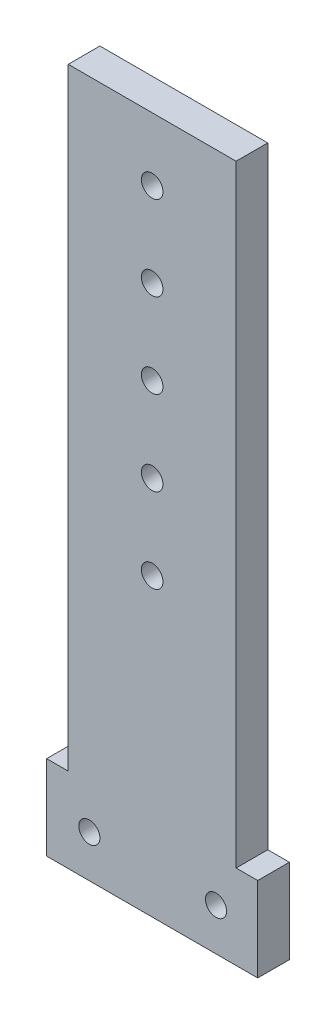
ISO-10303-21;
HEADER;
FILE_DESCRIPTION(('STEP AP214'),'2;1');
FILE_NAME('part.step','',(''),(''),'','','');
FILE_SCHEMA(('AUTOMOTIVE_DESIGN { 1 0 10303 214 1 1 1 1 }'));
ENDSEC;
DATA;
#1=APPLICATION_CONTEXT('core data for automotive mechanical design processes');
#2=APPLICATION_PROTOCOL_DEFINITION('international standard','automotive_design',2000,#1);
#3=PRODUCT_CONTEXT('',#1,'mechanical');
#4=PRODUCT('Part','Part','',(#3));
#5=PRODUCT_RELATED_PRODUCT_CATEGORY('part','',(#4));
#6=PRODUCT_DEFINITION_FORMATION('','',#4);
#7=PRODUCT_DEFINITION_CONTEXT('part definition',#1,'design');
#8=PRODUCT_DEFINITION('design','',#6,#7);
#9=PRODUCT_DEFINITION_SHAPE('','',#8);
#10=(LENGTH_UNIT() NAMED_UNIT(*) SI_UNIT(.MILLI.,.METRE.));
#11=(NAMED_UNIT(*) PLANE_ANGLE_UNIT() SI_UNIT($,.RADIAN.));
#12=(NAMED_UNIT(*) SI_UNIT($,.STERADIAN.) SOLID_ANGLE_UNIT());
#13=UNCERTAINTY_MEASURE_WITH_UNIT(LENGTH_MEASURE(1.E-05),#10,'distance_accuracy_value','');
#14=(GEOMETRIC_REPRESENTATION_CONTEXT(3) GLOBAL_UNCERTAINTY_ASSIGNED_CONTEXT((#13)) GLOBAL_UNIT_ASSIGNED_CONTEXT((#10,
#11,#12)) REPRESENTATION_CONTEXT('',''));
#15=CARTESIAN_POINT('',(0.,0.,0.));
#16=DIRECTION('',(0.,0.,1.));
#17=DIRECTION('',(1.,0.,0.));
#18=AXIS2_PLACEMENT_3D('',#15,#16,#17);
#19=CARTESIAN_POINT('',(0.,0.,9.525));
#20=DIRECTION('',(0.,0.,-1.));
#21=DIRECTION('',(-1.,0.,0.));
#22=AXIS2_PLACEMENT_3D('',#19,#20,#21);
#23=PLANE('',#22);
#24=DIRECTION('',(0.,1.,0.));
#25=VECTOR('',#24,1.);
#26=CARTESIAN_POINT('',(50.65,19.05,9.525));
#27=LINE('',#26,#25);
#28=CARTESIAN_POINT('',(50.65,19.05,9.525));
#29=VERTEX_POINT('',#28);
#30=CARTESIAN_POINT('',(50.65,203.2,9.525));
#31=VERTEX_POINT('',#30);
#32=EDGE_CURVE('E145',#29,#31,#27,.T.);
#33=ORIENTED_EDGE('',*,*,#32,.T.);
#34=DIRECTION('',(-1.,0.,0.));
#35=VECTOR('',#34,1.);
#36=CARTESIAN_POINT('',(0.149999999999997,203.2,9.525));
#37=LINE('',#36,#35);
#38=CARTESIAN_POINT('',(0.149999999999997,203.2,9.525));
#39=VERTEX_POINT('',#38);
#40=EDGE_CURVE('E93',#31,#39,#37,.T.);
#41=ORIENTED_EDGE('',*,*,#40,.T.);
#42=DIRECTION('',(0.,-1.,0.));
#43=VECTOR('',#42,1.);
#44=CARTESIAN_POINT('',(0.149999999999997,19.05,9.525));
#45=LINE('',#44,#43);
#46=CARTESIAN_POINT('',(0.149999999999997,19.05,9.525));
#47=VERTEX_POINT('',#46);
#48=EDGE_CURVE('E160',#39,#47,#45,.T.);
#49=ORIENTED_EDGE('',*,*,#48,.T.);
#50=DIRECTION('',(-1.,0.,0.));
#51=VECTOR('',#50,1.);
#52=CARTESIAN_POINT('',(0.149999999999997,19.05,9.525));
#53=LINE('',#52,#51);
#54=CARTESIAN_POINT('',(-6.35,19.05,9.525));
#55=VERTEX_POINT('',#54);
#56=EDGE_CURVE('E173',#47,#55,#53,.T.);
#57=ORIENTED_EDGE('',*,*,#56,.T.);
#58=DIRECTION('',(0.,-1.,0.));
#59=VECTOR('',#58,1.);
#60=CARTESIAN_POINT('',(-6.35,19.05,9.525));
#61=LINE('',#60,#59);
#62=CARTESIAN_POINT('',(-6.35,-6.35,9.525));
#63=VERTEX_POINT('',#62);
#64=EDGE_CURVE('E112',#55,#63,#61,.T.);
#65=ORIENTED_EDGE('',*,*,#64,.T.);
#66=DIRECTION('',(1.,0.,0.));
#67=VECTOR('',#66,1.);
#68=CARTESIAN_POINT('',(-6.35,-6.35,9.525));
#69=LINE('',#68,#67);
#70=CARTESIAN_POINT('',(57.15,-6.35,9.525));
#71=VERTEX_POINT('',#70);
#72=EDGE_CURVE('E106',#63,#71,#69,.T.);
#73=ORIENTED_EDGE('',*,*,#72,.T.);
#74=DIRECTION('',(0.,1.,0.));
#75=VECTOR('',#74,1.);
#76=CARTESIAN_POINT('',(57.15,-6.35,9.525));
#77=LINE('',#76,#75);
#78=CARTESIAN_POINT('',(57.15,19.05,9.525));
#79=VERTEX_POINT('',#78);
#80=EDGE_CURVE('E110',#71,#79,#77,.T.);
#81=ORIENTED_EDGE('',*,*,#80,.T.);
#82=DIRECTION('',(-1.,0.,0.));
#83=VECTOR('',#82,1.);
#84=CARTESIAN_POINT('',(57.15,19.05,9.525));
#85=LINE('',#84,#83);
#86=EDGE_CURVE('E50',#79,#29,#85,.T.);
#87=ORIENTED_EDGE('',*,*,#86,.T.);
#88=EDGE_LOOP('',(#33,#41,#49,#57,#65,#73,#81,#87));
#89=FACE_BOUND('',#88,.T.);
#90=CARTESIAN_POINT('',(6.5,6.35,9.525));
#91=DIRECTION('',(0.,0.,1.));
#92=DIRECTION('',(1.,0.,0.));
#93=AXIS2_PLACEMENT_3D('',#90,#91,#92);
#94=CIRCLE('',#93,3.175);
#95=CARTESIAN_POINT('',(9.675,6.35,9.525));
#96=VERTEX_POINT('',#95);
#97=EDGE_CURVE('E134',#96,#96,#94,.T.);
#98=ORIENTED_EDGE('',*,*,#97,.F.);
#99=EDGE_LOOP('',(#98));
#100=FACE_BOUND('',#99,.T.);
#101=CARTESIAN_POINT('',(44.6,6.35,9.525));
#102=DIRECTION('',(0.,0.,1.));
#103=DIRECTION('',(1.,0.,0.));
#104=AXIS2_PLACEMENT_3D('',#101,#102,#103);
#105=CIRCLE('',#104,3.175);
#106=CARTESIAN_POINT('',(47.775,6.35,9.525));
#107=VERTEX_POINT('',#106);
#108=EDGE_CURVE('E182',#107,#107,#105,.T.);
#109=ORIENTED_EDGE('',*,*,#108,.F.);
#110=EDGE_LOOP('',(#109));
#111=FACE_BOUND('',#110,.T.);
#112=CARTESIAN_POINT('',(25.4,184.2,9.525));
#113=DIRECTION('',(0.,0.,1.));
#114=DIRECTION('',(1.,0.,0.));
#115=AXIS2_PLACEMENT_3D('',#112,#113,#114);
#116=CIRCLE('',#115,3.25);
#117=CARTESIAN_POINT('',(28.65,184.2,9.525));
#118=VERTEX_POINT('',#117);
#119=EDGE_CURVE('E188',#118,#118,#116,.T.);
#120=ORIENTED_EDGE('',*,*,#119,.F.);
#121=EDGE_LOOP('',(#120));
#122=FACE_BOUND('',#121,.T.);
#123=CARTESIAN_POINT('',(25.4,158.8,9.525));
#124=DIRECTION('',(0.,0.,1.));
#125=DIRECTION('',(1.,0.,0.));
#126=AXIS2_PLACEMENT_3D('',#123,#124,#125);
#127=CIRCLE('',#126,3.25);
#128=CARTESIAN_POINT('',(28.65,158.8,9.525));
#129=VERTEX_POINT('',#128);
#130=EDGE_CURVE('E194',#129,#129,#127,.T.);
#131=ORIENTED_EDGE('',*,*,#130,.F.);
#132=EDGE_LOOP('',(#131));
#133=FACE_BOUND('',#132,.T.);
#134=CARTESIAN_POINT('',(25.4,133.4,9.525));
#135=DIRECTION('',(0.,0.,1.));
#136=DIRECTION('',(1.,0.,0.));
#137=AXIS2_PLACEMENT_3D('',#134,#135,#136);
#138=CIRCLE('',#137,3.25);
#139=CARTESIAN_POINT('',(28.65,133.4,9.525));
#140=VERTEX_POINT('',#139);
#141=EDGE_CURVE('E200',#140,#140,#138,.T.);
#142=ORIENTED_EDGE('',*,*,#141,.F.);
#143=EDGE_LOOP('',(#142));
#144=FACE_BOUND('',#143,.T.);
#145=CARTESIAN_POINT('',(25.4,108.,9.525));
#146=DIRECTION('',(0.,0.,1.));
#147=DIRECTION('',(1.,0.,0.));
#148=AXIS2_PLACEMENT_3D('',#145,#146,#147);
#149=CIRCLE('',#148,3.25);
#150=CARTESIAN_POINT('',(28.65,108.,9.525));
#151=VERTEX_POINT('',#150);
#152=EDGE_CURVE('E206',#151,#151,#149,.T.);
#153=ORIENTED_EDGE('',*,*,#152,.F.);
#154=EDGE_LOOP('',(#153));
#155=FACE_BOUND('',#154,.T.);
#156=CARTESIAN_POINT('',(25.4,82.6,9.525));
#157=DIRECTION('',(0.,0.,1.));
#158=DIRECTION('',(1.,0.,0.));
#159=AXIS2_PLACEMENT_3D('',#156,#157,#158);
#160=CIRCLE('',#159,3.25);
#161=CARTESIAN_POINT('',(28.65,82.6,9.525));
#162=VERTEX_POINT('',#161);
#163=EDGE_CURVE('E212',#162,#162,#160,.T.);
#164=ORIENTED_EDGE('',*,*,#163,.F.);
#165=EDGE_LOOP('',(#164));
#166=FACE_BOUND('',#165,.T.);
#167=ADVANCED_FACE('F33',(#89,#100,#111,#122,#133,#144,#155,#166),#23,.F.);
#168=CARTESIAN_POINT('',(0.,0.,0.));
#169=DIRECTION('',(0.,0.,-1.));
#170=DIRECTION('',(-1.,0.,0.));
#171=AXIS2_PLACEMENT_3D('',#168,#169,#170);
#172=PLANE('',#171);
#173=CARTESIAN_POINT('',(25.4,108.,0.));
#174=DIRECTION('',(0.,0.,1.));
#175=DIRECTION('',(1.,0.,0.));
#176=AXIS2_PLACEMENT_3D('',#173,#174,#175);
#177=CIRCLE('',#176,3.25);
#178=CARTESIAN_POINT('',(28.65,108.,0.));
#179=VERTEX_POINT('',#178);
#180=EDGE_CURVE('E209',#179,#179,#177,.T.);
#181=ORIENTED_EDGE('',*,*,#180,.T.);
#182=EDGE_LOOP('',(#181));
#183=FACE_BOUND('',#182,.T.);
#184=CARTESIAN_POINT('',(25.4,158.8,0.));
#185=DIRECTION('',(0.,0.,1.));
#186=DIRECTION('',(1.,0.,0.));
#187=AXIS2_PLACEMENT_3D('',#184,#185,#186);
#188=CIRCLE('',#187,3.25);
#189=CARTESIAN_POINT('',(28.65,158.8,0.));
#190=VERTEX_POINT('',#189);
#191=EDGE_CURVE('E197',#190,#190,#188,.T.);
#192=ORIENTED_EDGE('',*,*,#191,.T.);
#193=EDGE_LOOP('',(#192));
#194=FACE_BOUND('',#193,.T.);
#195=CARTESIAN_POINT('',(44.6,6.35,0.));
#196=DIRECTION('',(0.,0.,1.));
#197=DIRECTION('',(1.,0.,0.));
#198=AXIS2_PLACEMENT_3D('',#195,#196,#197);
#199=CIRCLE('',#198,3.175);
#200=CARTESIAN_POINT('',(47.775,6.35,0.));
#201=VERTEX_POINT('',#200);
#202=EDGE_CURVE('E185',#201,#201,#199,.T.);
#203=ORIENTED_EDGE('',*,*,#202,.T.);
#204=EDGE_LOOP('',(#203));
#205=FACE_BOUND('',#204,.T.);
#206=DIRECTION('',(0.,1.,0.));
#207=VECTOR('',#206,1.);
#208=CARTESIAN_POINT('',(50.65,19.05,0.));
#209=LINE('',#208,#207);
#210=CARTESIAN_POINT('',(50.65,19.05,0.));
#211=VERTEX_POINT('',#210);
#212=CARTESIAN_POINT('',(50.65,203.2,0.));
#213=VERTEX_POINT('',#212);
#214=EDGE_CURVE('E130',#211,#213,#209,.T.);
#215=ORIENTED_EDGE('',*,*,#214,.F.);
#216=DIRECTION('',(-1.,0.,0.));
#217=VECTOR('',#216,1.);
#218=CARTESIAN_POINT('',(57.15,19.05,0.));
#219=LINE('',#218,#217);
#220=CARTESIAN_POINT('',(57.15,19.05,0.));
#221=VERTEX_POINT('',#220);
#222=EDGE_CURVE('E85',#221,#211,#219,.T.);
#223=ORIENTED_EDGE('',*,*,#222,.F.);
#224=DIRECTION('',(0.,1.,0.));
#225=VECTOR('',#224,1.);
#226=CARTESIAN_POINT('',(57.15,-6.35,0.));
#227=LINE('',#226,#225);
#228=CARTESIAN_POINT('',(57.15,-6.35,0.));
#229=VERTEX_POINT('',#228);
#230=EDGE_CURVE('E79',#229,#221,#227,.T.);
#231=ORIENTED_EDGE('',*,*,#230,.F.);
#232=DIRECTION('',(1.,0.,0.));
#233=VECTOR('',#232,1.);
#234=CARTESIAN_POINT('',(-6.35,-6.35,0.));
#235=LINE('',#234,#233);
#236=CARTESIAN_POINT('',(-6.35,-6.35,0.));
#237=VERTEX_POINT('',#236);
#238=EDGE_CURVE('E120',#237,#229,#235,.T.);
#239=ORIENTED_EDGE('',*,*,#238,.F.);
#240=DIRECTION('',(0.,-1.,0.));
#241=VECTOR('',#240,1.);
#242=CARTESIAN_POINT('',(-6.35,19.05,0.));
#243=LINE('',#242,#241);
#244=CARTESIAN_POINT('',(-6.35,19.05,0.));
#245=VERTEX_POINT('',#244);
#246=EDGE_CURVE('E140',#245,#237,#243,.T.);
#247=ORIENTED_EDGE('',*,*,#246,.F.);
#248=DIRECTION('',(-1.,0.,0.));
#249=VECTOR('',#248,1.);
#250=CARTESIAN_POINT('',(0.149999999999997,19.05,0.));
#251=LINE('',#250,#249);
#252=CARTESIAN_POINT('',(0.149999999999997,19.05,0.));
#253=VERTEX_POINT('',#252);
#254=EDGE_CURVE('E138',#253,#245,#251,.T.);
#255=ORIENTED_EDGE('',*,*,#254,.F.);
#256=DIRECTION('',(0.,-1.,0.));
#257=VECTOR('',#256,1.);
#258=CARTESIAN_POINT('',(0.149999999999997,19.05,0.));
#259=LINE('',#258,#257);
#260=CARTESIAN_POINT('',(0.149999999999997,203.2,0.));
#261=VERTEX_POINT('',#260);
#262=EDGE_CURVE('E136',#261,#253,#259,.T.);
#263=ORIENTED_EDGE('',*,*,#262,.F.);
#264=DIRECTION('',(-1.,0.,0.));
#265=VECTOR('',#264,1.);
#266=CARTESIAN_POINT('',(0.149999999999997,203.2,0.));
#267=LINE('',#266,#265);
#268=EDGE_CURVE('E133',#213,#261,#267,.T.);
#269=ORIENTED_EDGE('',*,*,#268,.F.);
#270=EDGE_LOOP('',(#215,#223,#231,#239,#247,#255,#263,#269));
#271=FACE_BOUND('',#270,.T.);
#272=CARTESIAN_POINT('',(6.5,6.35,0.));
#273=DIRECTION('',(0.,0.,1.));
#274=DIRECTION('',(1.,0.,0.));
#275=AXIS2_PLACEMENT_3D('',#272,#273,#274);
#276=CIRCLE('',#275,3.175);
#277=CARTESIAN_POINT('',(9.675,6.35,0.));
#278=VERTEX_POINT('',#277);
#279=EDGE_CURVE('E179',#278,#278,#276,.T.);
#280=ORIENTED_EDGE('',*,*,#279,.T.);
#281=EDGE_LOOP('',(#280));
#282=FACE_BOUND('',#281,.T.);
#283=CARTESIAN_POINT('',(25.4,184.2,0.));
#284=DIRECTION('',(0.,0.,1.));
#285=DIRECTION('',(1.,0.,0.));
#286=AXIS2_PLACEMENT_3D('',#283,#284,#285);
#287=CIRCLE('',#286,3.25);
#288=CARTESIAN_POINT('',(28.65,184.2,0.));
#289=VERTEX_POINT('',#288);
#290=EDGE_CURVE('E191',#289,#289,#287,.T.);
#291=ORIENTED_EDGE('',*,*,#290,.T.);
#292=EDGE_LOOP('',(#291));
#293=FACE_BOUND('',#292,.T.);
#294=CARTESIAN_POINT('',(25.4,133.4,0.));
#295=DIRECTION('',(0.,0.,1.));
#296=DIRECTION('',(1.,0.,0.));
#297=AXIS2_PLACEMENT_3D('',#294,#295,#296);
#298=CIRCLE('',#297,3.25);
#299=CARTESIAN_POINT('',(28.65,133.4,0.));
#300=VERTEX_POINT('',#299);
#301=EDGE_CURVE('E203',#300,#300,#298,.T.);
#302=ORIENTED_EDGE('',*,*,#301,.T.);
#303=EDGE_LOOP('',(#302));
#304=FACE_BOUND('',#303,.T.);
#305=CARTESIAN_POINT('',(25.4,82.6,0.));
#306=DIRECTION('',(0.,0.,1.));
#307=DIRECTION('',(1.,0.,0.));
#308=AXIS2_PLACEMENT_3D('',#305,#306,#307);
#309=CIRCLE('',#308,3.25);
#310=CARTESIAN_POINT('',(28.65,82.6,0.));
#311=VERTEX_POINT('',#310);
#312=EDGE_CURVE('E215',#311,#311,#309,.T.);
#313=ORIENTED_EDGE('',*,*,#312,.T.);
#314=EDGE_LOOP('',(#313));
#315=FACE_BOUND('',#314,.T.);
#316=ADVANCED_FACE('F164',(#183,#194,#205,#271,#282,#293,#304,#315),#172,.T.);
#317=CARTESIAN_POINT('',(50.65,19.05,9.525));
#318=DIRECTION('',(-1.,0.,0.));
#319=DIRECTION('',(0.,0.,1.));
#320=AXIS2_PLACEMENT_3D('',#317,#318,#319);
#321=PLANE('',#320);
#322=ORIENTED_EDGE('',*,*,#214,.T.);
#323=DIRECTION('',(0.,0.,-1.));
#324=VECTOR('',#323,1.);
#325=CARTESIAN_POINT('',(50.65,203.2,9.525));
#326=LINE('',#325,#324);
#327=EDGE_CURVE('E11',#31,#213,#326,.T.);
#328=ORIENTED_EDGE('',*,*,#327,.F.);
#329=ORIENTED_EDGE('',*,*,#32,.F.);
#330=DIRECTION('',(0.,0.,-1.));
#331=VECTOR('',#330,1.);
#332=CARTESIAN_POINT('',(50.65,19.05,9.525));
#333=LINE('',#332,#331);
#334=EDGE_CURVE('E126',#29,#211,#333,.T.);
#335=ORIENTED_EDGE('',*,*,#334,.T.);
#336=EDGE_LOOP('',(#322,#328,#329,#335));
#337=FACE_BOUND('',#336,.T.);
#338=ADVANCED_FACE('F35',(#337),#321,.F.);
#339=CARTESIAN_POINT('',(0.149999999999997,203.2,9.525));
#340=DIRECTION('',(0.,-1.,0.));
#341=DIRECTION('',(0.,0.,-1.));
#342=AXIS2_PLACEMENT_3D('',#339,#340,#341);
#343=PLANE('',#342);
#344=ORIENTED_EDGE('',*,*,#268,.T.);
#345=DIRECTION('',(0.,0.,-1.));
#346=VECTOR('',#345,1.);
#347=CARTESIAN_POINT('',(0.149999999999997,203.2,9.525));
#348=LINE('',#347,#346);
#349=EDGE_CURVE('E42',#39,#261,#348,.T.);
#350=ORIENTED_EDGE('',*,*,#349,.F.);
#351=ORIENTED_EDGE('',*,*,#40,.F.);
#352=ORIENTED_EDGE('',*,*,#327,.T.);
#353=EDGE_LOOP('',(#344,#350,#351,#352));
#354=FACE_BOUND('',#353,.T.);
#355=ADVANCED_FACE('F247',(#354),#343,.F.);
#356=CARTESIAN_POINT('',(0.149999999999997,19.05,9.525));
#357=DIRECTION('',(1.,0.,0.));
#358=DIRECTION('',(0.,0.,-1.));
#359=AXIS2_PLACEMENT_3D('',#356,#357,#358);
#360=PLANE('',#359);
#361=ORIENTED_EDGE('',*,*,#262,.T.);
#362=DIRECTION('',(0.,0.,-1.));
#363=VECTOR('',#362,1.);
#364=CARTESIAN_POINT('',(0.149999999999997,19.05,9.525));
#365=LINE('',#364,#363);
#366=EDGE_CURVE('E152',#47,#253,#365,.T.);
#367=ORIENTED_EDGE('',*,*,#366,.F.);
#368=ORIENTED_EDGE('',*,*,#48,.F.);
#369=ORIENTED_EDGE('',*,*,#349,.T.);
#370=EDGE_LOOP('',(#361,#367,#368,#369));
#371=FACE_BOUND('',#370,.T.);
#372=ADVANCED_FACE('F158',(#371),#360,.F.);
#373=CARTESIAN_POINT('',(0.149999999999997,19.05,9.525));
#374=DIRECTION('',(0.,-1.,0.));
#375=DIRECTION('',(0.,0.,-1.));
#376=AXIS2_PLACEMENT_3D('',#373,#374,#375);
#377=PLANE('',#376);
#378=ORIENTED_EDGE('',*,*,#254,.T.);
#379=DIRECTION('',(0.,0.,-1.));
#380=VECTOR('',#379,1.);
#381=CARTESIAN_POINT('',(-6.35,19.05,9.525));
#382=LINE('',#381,#380);
#383=EDGE_CURVE('E149',#55,#245,#382,.T.);
#384=ORIENTED_EDGE('',*,*,#383,.F.);
#385=ORIENTED_EDGE('',*,*,#56,.F.);
#386=ORIENTED_EDGE('',*,*,#366,.T.);
#387=EDGE_LOOP('',(#378,#384,#385,#386));
#388=FACE_BOUND('',#387,.T.);
#389=ADVANCED_FACE('F169',(#388),#377,.F.);
#390=CARTESIAN_POINT('',(-6.35,19.05,9.525));
#391=DIRECTION('',(1.,0.,0.));
#392=DIRECTION('',(0.,0.,-1.));
#393=AXIS2_PLACEMENT_3D('',#390,#391,#392);
#394=PLANE('',#393);
#395=ORIENTED_EDGE('',*,*,#246,.T.);
#396=DIRECTION('',(0.,0.,-1.));
#397=VECTOR('',#396,1.);
#398=CARTESIAN_POINT('',(-6.35,-6.35,9.525));
#399=LINE('',#398,#397);
#400=EDGE_CURVE('E121',#63,#237,#399,.T.);
#401=ORIENTED_EDGE('',*,*,#400,.F.);
#402=ORIENTED_EDGE('',*,*,#64,.F.);
#403=ORIENTED_EDGE('',*,*,#383,.T.);
#404=EDGE_LOOP('',(#395,#401,#402,#403));
#405=FACE_BOUND('',#404,.T.);
#406=ADVANCED_FACE('F172',(#405),#394,.F.);
#407=CARTESIAN_POINT('',(-6.35,-6.35,9.525));
#408=DIRECTION('',(0.,1.,0.));
#409=DIRECTION('',(-1.,0.,0.));
#410=AXIS2_PLACEMENT_3D('',#407,#408,#409);
#411=PLANE('',#410);
#412=ORIENTED_EDGE('',*,*,#238,.T.);
#413=DIRECTION('',(0.,0.,-1.));
#414=VECTOR('',#413,1.);
#415=CARTESIAN_POINT('',(57.15,-6.35,9.525));
#416=LINE('',#415,#414);
#417=EDGE_CURVE('E117',#71,#229,#416,.T.);
#418=ORIENTED_EDGE('',*,*,#417,.F.);
#419=ORIENTED_EDGE('',*,*,#72,.F.);
#420=ORIENTED_EDGE('',*,*,#400,.T.);
#421=EDGE_LOOP('',(#412,#418,#419,#420));
#422=FACE_BOUND('',#421,.T.);
#423=ADVANCED_FACE('F118',(#422),#411,.F.);
#424=CARTESIAN_POINT('',(57.15,-6.35,9.525));
#425=DIRECTION('',(-1.,0.,0.));
#426=DIRECTION('',(0.,0.,1.));
#427=AXIS2_PLACEMENT_3D('',#424,#425,#426);
#428=PLANE('',#427);
#429=ORIENTED_EDGE('',*,*,#230,.T.);
#430=DIRECTION('',(0.,0.,-1.));
#431=VECTOR('',#430,1.);
#432=CARTESIAN_POINT('',(57.15,19.05,9.525));
#433=LINE('',#432,#431);
#434=EDGE_CURVE('E122',#79,#221,#433,.T.);
#435=ORIENTED_EDGE('',*,*,#434,.F.);
#436=ORIENTED_EDGE('',*,*,#80,.F.);
#437=ORIENTED_EDGE('',*,*,#417,.T.);
#438=EDGE_LOOP('',(#429,#435,#436,#437));
#439=FACE_BOUND('',#438,.T.);
#440=ADVANCED_FACE('F124',(#439),#428,.F.);
#441=CARTESIAN_POINT('',(57.15,19.05,9.525));
#442=DIRECTION('',(0.,-1.,0.));
#443=DIRECTION('',(1.,0.,0.));
#444=AXIS2_PLACEMENT_3D('',#441,#442,#443);
#445=PLANE('',#444);
#446=ORIENTED_EDGE('',*,*,#222,.T.);
#447=ORIENTED_EDGE('',*,*,#334,.F.);
#448=ORIENTED_EDGE('',*,*,#86,.F.);
#449=ORIENTED_EDGE('',*,*,#434,.T.);
#450=EDGE_LOOP('',(#446,#447,#448,#449));
#451=FACE_BOUND('',#450,.T.);
#452=ADVANCED_FACE('F235',(#451),#445,.F.);
#453=CARTESIAN_POINT('',(6.5,6.35,9.525));
#454=DIRECTION('',(0.,0.,-1.));
#455=DIRECTION('',(-1.,0.,0.));
#456=AXIS2_PLACEMENT_3D('',#453,#454,#455);
#457=CYLINDRICAL_SURFACE('',#456,3.175);
#458=ORIENTED_EDGE('',*,*,#97,.T.);
#459=EDGE_LOOP('',(#458));
#460=FACE_BOUND('',#459,.T.);
#461=ORIENTED_EDGE('',*,*,#279,.F.);
#462=EDGE_LOOP('',(#461));
#463=FACE_BOUND('',#462,.T.);
#464=ADVANCED_FACE('F232',(#460,#463),#457,.F.);
#465=CARTESIAN_POINT('',(44.6,6.35,9.525));
#466=DIRECTION('',(0.,0.,-1.));
#467=DIRECTION('',(-1.,0.,0.));
#468=AXIS2_PLACEMENT_3D('',#465,#466,#467);
#469=CYLINDRICAL_SURFACE('',#468,3.175);
#470=ORIENTED_EDGE('',*,*,#108,.T.);
#471=EDGE_LOOP('',(#470));
#472=FACE_BOUND('',#471,.T.);
#473=ORIENTED_EDGE('',*,*,#202,.F.);
#474=EDGE_LOOP('',(#473));
#475=FACE_BOUND('',#474,.T.);
#476=ADVANCED_FACE('F311',(#472,#475),#469,.F.);
#477=CARTESIAN_POINT('',(25.4,184.2,9.525));
#478=DIRECTION('',(0.,0.,-1.));
#479=DIRECTION('',(-1.,0.,0.));
#480=AXIS2_PLACEMENT_3D('',#477,#478,#479);
#481=CYLINDRICAL_SURFACE('',#480,3.25);
#482=ORIENTED_EDGE('',*,*,#119,.T.);
#483=EDGE_LOOP('',(#482));
#484=FACE_BOUND('',#483,.T.);
#485=ORIENTED_EDGE('',*,*,#290,.F.);
#486=EDGE_LOOP('',(#485));
#487=FACE_BOUND('',#486,.T.);
#488=ADVANCED_FACE('F319',(#484,#487),#481,.F.);
#489=CARTESIAN_POINT('',(25.4,158.8,9.525));
#490=DIRECTION('',(0.,0.,-1.));
#491=DIRECTION('',(-1.,0.,0.));
#492=AXIS2_PLACEMENT_3D('',#489,#490,#491);
#493=CYLINDRICAL_SURFACE('',#492,3.25);
#494=ORIENTED_EDGE('',*,*,#130,.T.);
#495=EDGE_LOOP('',(#494));
#496=FACE_BOUND('',#495,.T.);
#497=ORIENTED_EDGE('',*,*,#191,.F.);
#498=EDGE_LOOP('',(#497));
#499=FACE_BOUND('',#498,.T.);
#500=ADVANCED_FACE('F327',(#496,#499),#493,.F.);
#501=CARTESIAN_POINT('',(25.4,133.4,9.525));
#502=DIRECTION('',(0.,0.,-1.));
#503=DIRECTION('',(-1.,0.,0.));
#504=AXIS2_PLACEMENT_3D('',#501,#502,#503);
#505=CYLINDRICAL_SURFACE('',#504,3.25);
#506=ORIENTED_EDGE('',*,*,#141,.T.);
#507=EDGE_LOOP('',(#506));
#508=FACE_BOUND('',#507,.T.);
#509=ORIENTED_EDGE('',*,*,#301,.F.);
#510=EDGE_LOOP('',(#509));
#511=FACE_BOUND('',#510,.T.);
#512=ADVANCED_FACE('F336',(#508,#511),#505,.F.);
#513=CARTESIAN_POINT('',(25.4,108.,9.525));
#514=DIRECTION('',(0.,0.,-1.));
#515=DIRECTION('',(-1.,0.,0.));
#516=AXIS2_PLACEMENT_3D('',#513,#514,#515);
#517=CYLINDRICAL_SURFACE('',#516,3.25);
#518=ORIENTED_EDGE('',*,*,#152,.T.);
#519=EDGE_LOOP('',(#518));
#520=FACE_BOUND('',#519,.T.);
#521=ORIENTED_EDGE('',*,*,#180,.F.);
#522=EDGE_LOOP('',(#521));
#523=FACE_BOUND('',#522,.T.);
#524=ADVANCED_FACE('F345',(#520,#523),#517,.F.);
#525=CARTESIAN_POINT('',(25.4,82.6,9.525));
#526=DIRECTION('',(0.,0.,-1.));
#527=DIRECTION('',(-1.,0.,0.));
#528=AXIS2_PLACEMENT_3D('',#525,#526,#527);
#529=CYLINDRICAL_SURFACE('',#528,3.25);
#530=ORIENTED_EDGE('',*,*,#163,.T.);
#531=EDGE_LOOP('',(#530));
#532=FACE_BOUND('',#531,.T.);
#533=ORIENTED_EDGE('',*,*,#312,.F.);
#534=EDGE_LOOP('',(#533));
#535=FACE_BOUND('',#534,.T.);
#536=ADVANCED_FACE('F221',(#532,#535),#529,.F.);
#537=CLOSED_SHELL('',(#167,#316,#338,#355,#372,#389,#406,#423,#440,#452,#464,#476,#488,#500,
#512,#524,#536));
#538=MANIFOLD_SOLID_BREP('B2',#537);
#539=ADVANCED_BREP_SHAPE_REPRESENTATION('',(#18,#538),#14);
#540=SHAPE_DEFINITION_REPRESENTATION(#9,#539);
ENDSEC;
END-ISO-10303-21;
